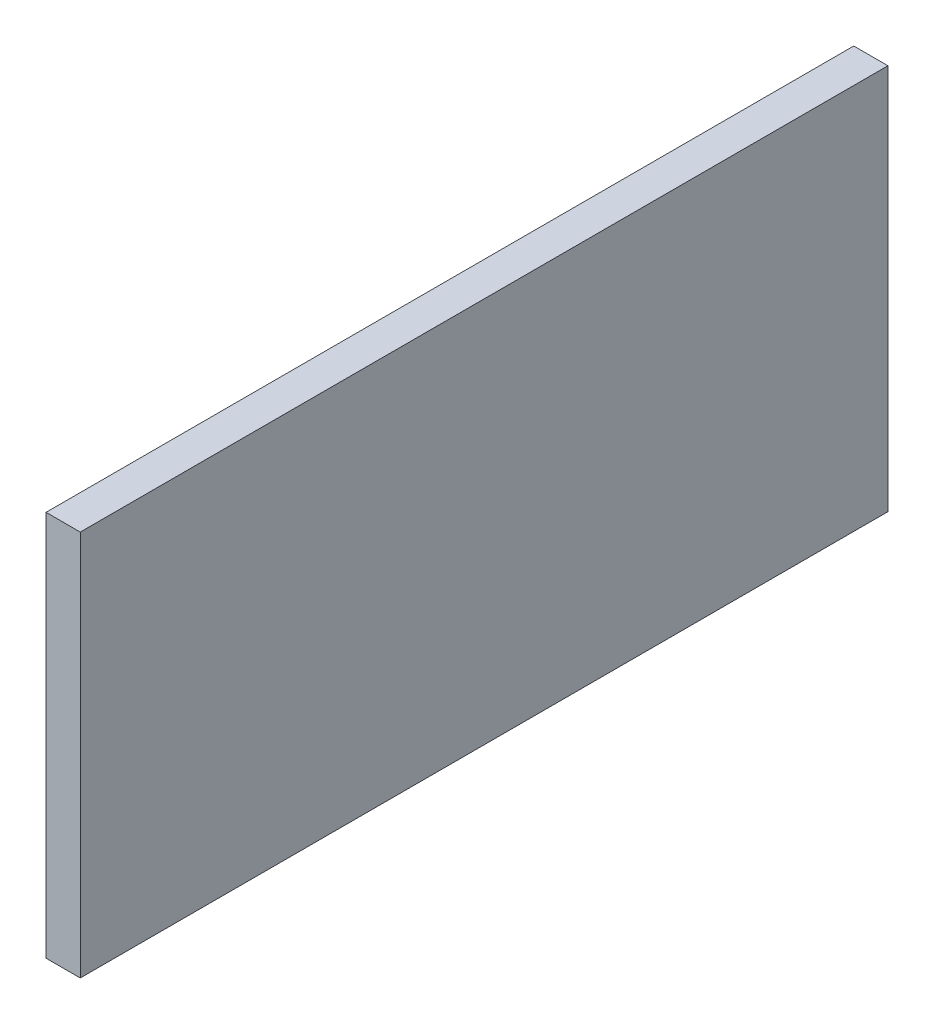
ISO-10303-21;
HEADER;
FILE_DESCRIPTION(('STEP AP214'),'2;1');
FILE_NAME('part.step','',(''),(''),'','','');
FILE_SCHEMA(('AUTOMOTIVE_DESIGN { 1 0 10303 214 1 1 1 1 }'));
ENDSEC;
DATA;
#1=APPLICATION_CONTEXT('core data for automotive mechanical design processes');
#2=APPLICATION_PROTOCOL_DEFINITION('international standard','automotive_design',2000,#1);
#3=PRODUCT_CONTEXT('',#1,'mechanical');
#4=PRODUCT('Part','Part','',(#3));
#5=PRODUCT_RELATED_PRODUCT_CATEGORY('part','',(#4));
#6=PRODUCT_DEFINITION_FORMATION('','',#4);
#7=PRODUCT_DEFINITION_CONTEXT('part definition',#1,'design');
#8=PRODUCT_DEFINITION('design','',#6,#7);
#9=PRODUCT_DEFINITION_SHAPE('','',#8);
#10=(LENGTH_UNIT() NAMED_UNIT(*) SI_UNIT(.MILLI.,.METRE.));
#11=(NAMED_UNIT(*) PLANE_ANGLE_UNIT() SI_UNIT($,.RADIAN.));
#12=(NAMED_UNIT(*) SI_UNIT($,.STERADIAN.) SOLID_ANGLE_UNIT());
#13=UNCERTAINTY_MEASURE_WITH_UNIT(LENGTH_MEASURE(1.E-05),#10,'distance_accuracy_value','');
#14=(GEOMETRIC_REPRESENTATION_CONTEXT(3) GLOBAL_UNCERTAINTY_ASSIGNED_CONTEXT((#13)) GLOBAL_UNIT_ASSIGNED_CONTEXT((#10,
#11,#12)) REPRESENTATION_CONTEXT('',''));
#15=CARTESIAN_POINT('',(0.,0.,0.));
#16=DIRECTION('',(0.,0.,1.));
#17=DIRECTION('',(1.,0.,0.));
#18=AXIS2_PLACEMENT_3D('',#15,#16,#17);
#19=CARTESIAN_POINT('',(3.,-8.51639216627418,-6.34353851886209));
#20=DIRECTION('',(0.,0.,1.));
#21=DIRECTION('',(0.,-1.,0.));
#22=AXIS2_PLACEMENT_3D('',#19,#20,#21);
#23=PLANE('',#22);
#24=DIRECTION('',(0.,1.,0.));
#25=VECTOR('',#24,1.);
#26=CARTESIAN_POINT('',(0.,-8.51639216627418,-6.34353851886209));
#27=LINE('',#26,#25);
#28=CARTESIAN_POINT('',(0.,-42.3933570343115,-6.3435385188621));
#29=VERTEX_POINT('',#28);
#30=CARTESIAN_POINT('',(0.,-8.51639216627418,-6.34353851886209));
#31=VERTEX_POINT('',#30);
#32=EDGE_CURVE('E96',#29,#31,#27,.T.);
#33=ORIENTED_EDGE('',*,*,#32,.T.);
#34=DIRECTION('',(-1.,0.,0.));
#35=VECTOR('',#34,1.);
#36=CARTESIAN_POINT('',(3.,-8.51639216627418,-6.34353851886209));
#37=LINE('',#36,#35);
#38=CARTESIAN_POINT('',(3.,-8.51639216627418,-6.34353851886209));
#39=VERTEX_POINT('',#38);
#40=EDGE_CURVE('E11',#39,#31,#37,.T.);
#41=ORIENTED_EDGE('',*,*,#40,.F.);
#42=DIRECTION('',(0.,1.,0.));
#43=VECTOR('',#42,1.);
#44=CARTESIAN_POINT('',(3.,-8.51639216627418,-6.34353851886209));
#45=LINE('',#44,#43);
#46=CARTESIAN_POINT('',(3.,-42.3933570343115,-6.3435385188621));
#47=VERTEX_POINT('',#46);
#48=EDGE_CURVE('E84',#47,#39,#45,.T.);
#49=ORIENTED_EDGE('',*,*,#48,.F.);
#50=DIRECTION('',(-1.,0.,0.));
#51=VECTOR('',#50,1.);
#52=CARTESIAN_POINT('',(3.,-42.3933570343115,-6.3435385188621));
#53=LINE('',#52,#51);
#54=EDGE_CURVE('E92',#47,#29,#53,.T.);
#55=ORIENTED_EDGE('',*,*,#54,.T.);
#56=EDGE_LOOP('',(#33,#41,#49,#55));
#57=FACE_BOUND('',#56,.T.);
#58=ADVANCED_FACE('F33',(#57),#23,.F.);
#59=CARTESIAN_POINT('',(3.,-8.51639216627418,64.5070361937816));
#60=DIRECTION('',(0.,-1.,0.));
#61=DIRECTION('',(0.,0.,-1.));
#62=AXIS2_PLACEMENT_3D('',#59,#60,#61);
#63=PLANE('',#62);
#64=DIRECTION('',(0.,0.,1.));
#65=VECTOR('',#64,1.);
#66=CARTESIAN_POINT('',(0.,-8.51639216627418,64.5070361937816));
#67=LINE('',#66,#65);
#68=CARTESIAN_POINT('',(0.,-8.51639216627418,64.5070361937816));
#69=VERTEX_POINT('',#68);
#70=EDGE_CURVE('E88',#31,#69,#67,.T.);
#71=ORIENTED_EDGE('',*,*,#70,.T.);
#72=DIRECTION('',(-1.,0.,0.));
#73=VECTOR('',#72,1.);
#74=CARTESIAN_POINT('',(3.,-8.51639216627418,64.5070361937816));
#75=LINE('',#74,#73);
#76=CARTESIAN_POINT('',(3.,-8.51639216627418,64.5070361937816));
#77=VERTEX_POINT('',#76);
#78=EDGE_CURVE('E41',#77,#69,#75,.T.);
#79=ORIENTED_EDGE('',*,*,#78,.F.);
#80=DIRECTION('',(0.,0.,1.));
#81=VECTOR('',#80,1.);
#82=CARTESIAN_POINT('',(3.,-8.51639216627418,64.5070361937816));
#83=LINE('',#82,#81);
#84=EDGE_CURVE('E79',#39,#77,#83,.T.);
#85=ORIENTED_EDGE('',*,*,#84,.F.);
#86=ORIENTED_EDGE('',*,*,#40,.T.);
#87=EDGE_LOOP('',(#71,#79,#85,#86));
#88=FACE_BOUND('',#87,.T.);
#89=ADVANCED_FACE('F87',(#88),#63,.F.);
#90=CARTESIAN_POINT('',(3.,-8.51639216627418,64.5070361937816));
#91=DIRECTION('',(0.,0.,-1.));
#92=DIRECTION('',(-1.,0.,0.));
#93=AXIS2_PLACEMENT_3D('',#90,#91,#92);
#94=PLANE('',#93);
#95=DIRECTION('',(0.,-1.,0.));
#96=VECTOR('',#95,1.);
#97=CARTESIAN_POINT('',(0.,-8.51639216627418,64.5070361937816));
#98=LINE('',#97,#96);
#99=CARTESIAN_POINT('',(0.,-42.3933570343115,64.5070361937816));
#100=VERTEX_POINT('',#99);
#101=EDGE_CURVE('E66',#69,#100,#98,.T.);
#102=ORIENTED_EDGE('',*,*,#101,.T.);
#103=DIRECTION('',(-1.,0.,0.));
#104=VECTOR('',#103,1.);
#105=CARTESIAN_POINT('',(3.,-42.3933570343115,64.5070361937816));
#106=LINE('',#105,#104);
#107=CARTESIAN_POINT('',(3.,-42.3933570343115,64.5070361937816));
#108=VERTEX_POINT('',#107);
#109=EDGE_CURVE('E89',#108,#100,#106,.T.);
#110=ORIENTED_EDGE('',*,*,#109,.F.);
#111=DIRECTION('',(0.,-1.,0.));
#112=VECTOR('',#111,1.);
#113=CARTESIAN_POINT('',(3.,-8.51639216627418,64.5070361937816));
#114=LINE('',#113,#112);
#115=EDGE_CURVE('E82',#77,#108,#114,.T.);
#116=ORIENTED_EDGE('',*,*,#115,.F.);
#117=ORIENTED_EDGE('',*,*,#78,.T.);
#118=EDGE_LOOP('',(#102,#110,#116,#117));
#119=FACE_BOUND('',#118,.T.);
#120=ADVANCED_FACE('F90',(#119),#94,.F.);
#121=CARTESIAN_POINT('',(3.,-42.3933570343115,64.5070361937816));
#122=DIRECTION('',(0.,1.,0.));
#123=DIRECTION('',(0.,0.,1.));
#124=AXIS2_PLACEMENT_3D('',#121,#122,#123);
#125=PLANE('',#124);
#126=DIRECTION('',(0.,0.,-1.));
#127=VECTOR('',#126,1.);
#128=CARTESIAN_POINT('',(0.,-42.3933570343115,64.5070361937816));
#129=LINE('',#128,#127);
#130=EDGE_CURVE('E72',#100,#29,#129,.T.);
#131=ORIENTED_EDGE('',*,*,#130,.T.);
#132=ORIENTED_EDGE('',*,*,#54,.F.);
#133=DIRECTION('',(0.,0.,-1.));
#134=VECTOR('',#133,1.);
#135=CARTESIAN_POINT('',(3.,-42.3933570343115,64.5070361937816));
#136=LINE('',#135,#134);
#137=EDGE_CURVE('E49',#108,#47,#136,.T.);
#138=ORIENTED_EDGE('',*,*,#137,.F.);
#139=ORIENTED_EDGE('',*,*,#109,.T.);
#140=EDGE_LOOP('',(#131,#132,#138,#139));
#141=FACE_BOUND('',#140,.T.);
#142=ADVANCED_FACE('F103',(#141),#125,.F.);
#143=CARTESIAN_POINT('',(3.,0.,0.));
#144=DIRECTION('',(1.,0.,0.));
#145=DIRECTION('',(0.,0.,-1.));
#146=AXIS2_PLACEMENT_3D('',#143,#144,#145);
#147=PLANE('',#146);
#148=ORIENTED_EDGE('',*,*,#48,.T.);
#149=ORIENTED_EDGE('',*,*,#84,.T.);
#150=ORIENTED_EDGE('',*,*,#115,.T.);
#151=ORIENTED_EDGE('',*,*,#137,.T.);
#152=EDGE_LOOP('',(#148,#149,#150,#151));
#153=FACE_BOUND('',#152,.T.);
#154=ADVANCED_FACE('F80',(#153),#147,.T.);
#155=CARTESIAN_POINT('',(0.,0.,0.));
#156=DIRECTION('',(1.,0.,0.));
#157=DIRECTION('',(0.,0.,-1.));
#158=AXIS2_PLACEMENT_3D('',#155,#156,#157);
#159=PLANE('',#158);
#160=ORIENTED_EDGE('',*,*,#32,.F.);
#161=ORIENTED_EDGE('',*,*,#130,.F.);
#162=ORIENTED_EDGE('',*,*,#101,.F.);
#163=ORIENTED_EDGE('',*,*,#70,.F.);
#164=EDGE_LOOP('',(#160,#161,#162,#163));
#165=FACE_BOUND('',#164,.T.);
#166=ADVANCED_FACE('F106',(#165),#159,.F.);
#167=CLOSED_SHELL('',(#58,#89,#120,#142,#154,#166));
#168=MANIFOLD_SOLID_BREP('B2',#167);
#169=ADVANCED_BREP_SHAPE_REPRESENTATION('',(#18,#168),#14);
#170=SHAPE_DEFINITION_REPRESENTATION(#9,#169);
ENDSEC;
END-ISO-10303-21;
